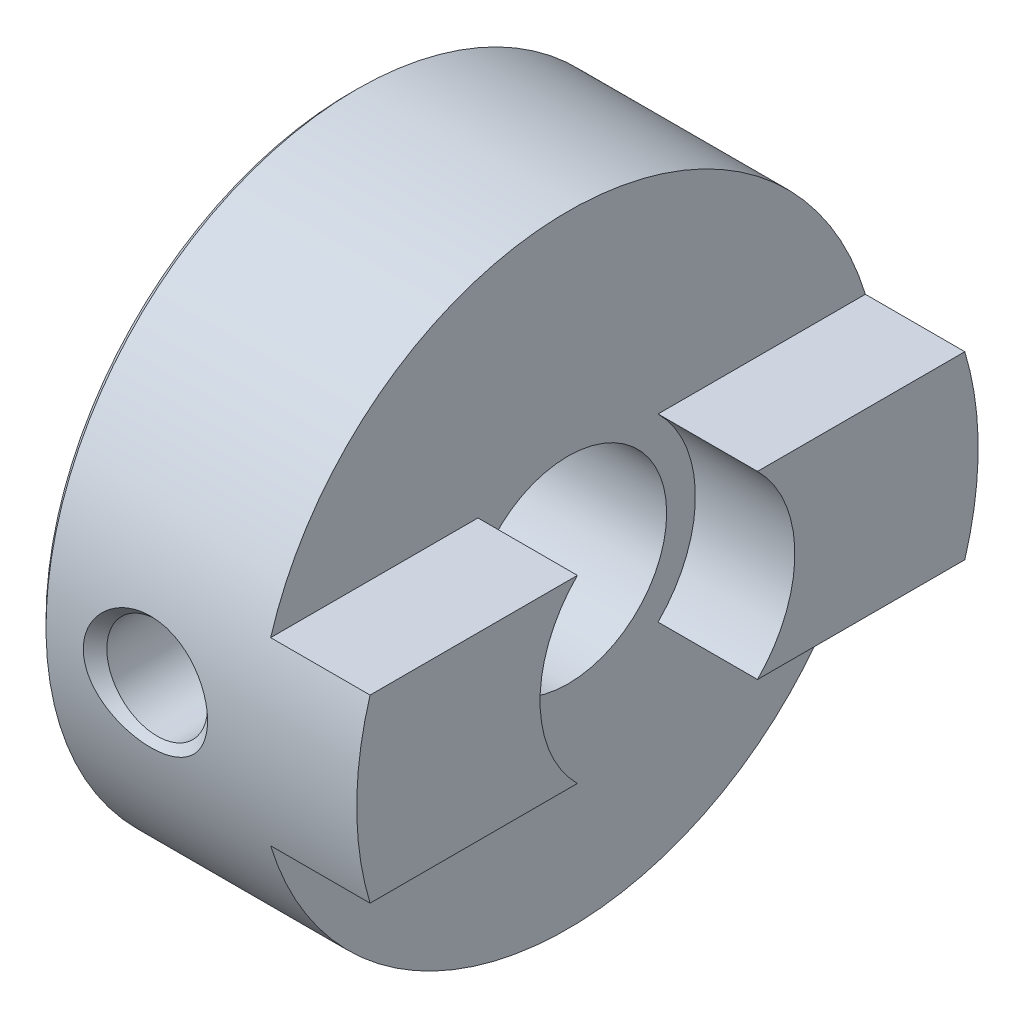
ISO-10303-21;
HEADER;
FILE_DESCRIPTION(('STEP AP214'),'2;1');
FILE_NAME('part.step','',(''),(''),'','','');
FILE_SCHEMA(('AUTOMOTIVE_DESIGN { 1 0 10303 214 1 1 1 1 }'));
ENDSEC;
DATA;
#1=APPLICATION_CONTEXT('core data for automotive mechanical design processes');
#2=APPLICATION_PROTOCOL_DEFINITION('international standard','automotive_design',2000,#1);
#3=PRODUCT_CONTEXT('',#1,'mechanical');
#4=PRODUCT('Part','Part','',(#3));
#5=PRODUCT_RELATED_PRODUCT_CATEGORY('part','',(#4));
#6=PRODUCT_DEFINITION_FORMATION('','',#4);
#7=PRODUCT_DEFINITION_CONTEXT('part definition',#1,'design');
#8=PRODUCT_DEFINITION('design','',#6,#7);
#9=PRODUCT_DEFINITION_SHAPE('','',#8);
#10=(LENGTH_UNIT() NAMED_UNIT(*) SI_UNIT(.MILLI.,.METRE.));
#11=(NAMED_UNIT(*) PLANE_ANGLE_UNIT() SI_UNIT($,.RADIAN.));
#12=(NAMED_UNIT(*) SI_UNIT($,.STERADIAN.) SOLID_ANGLE_UNIT());
#13=UNCERTAINTY_MEASURE_WITH_UNIT(LENGTH_MEASURE(1.E-05),#10,'distance_accuracy_value','');
#14=(GEOMETRIC_REPRESENTATION_CONTEXT(3) GLOBAL_UNCERTAINTY_ASSIGNED_CONTEXT((#13)) GLOBAL_UNIT_ASSIGNED_CONTEXT((#10,
#11,#12)) REPRESENTATION_CONTEXT('',''));
#15=CARTESIAN_POINT('',(0.,0.,0.));
#16=DIRECTION('',(0.,0.,1.));
#17=DIRECTION('',(1.,0.,0.));
#18=AXIS2_PLACEMENT_3D('',#15,#16,#17);
#19=CARTESIAN_POINT('',(-2.1,0.,0.));
#20=DIRECTION('',(1.,0.,0.));
#21=DIRECTION('',(0.,0.,-1.));
#22=AXIS2_PLACEMENT_3D('',#19,#20,#21);
#23=CYLINDRICAL_SURFACE('',#22,4.1);
#24=CARTESIAN_POINT('',(-3.7,0.,0.));
#25=DIRECTION('',(1.,0.,0.));
#26=DIRECTION('',(0.,0.,-1.));
#27=AXIS2_PLACEMENT_3D('',#24,#25,#26);
#28=CIRCLE('',#27,4.1);
#29=CARTESIAN_POINT('',(-3.7,-2.9,2.89827534923789));
#30=VERTEX_POINT('',#29);
#31=CARTESIAN_POINT('',(-3.7,2.9,2.89827534923789));
#32=VERTEX_POINT('',#31);
#33=EDGE_CURVE('E205',#30,#32,#28,.F.);
#34=ORIENTED_EDGE('',*,*,#33,.T.);
#35=DIRECTION('',(1.,0.,0.));
#36=VECTOR('',#35,1.);
#37=CARTESIAN_POINT('',(-0.5,2.9,2.89827534923789));
#38=LINE('',#37,#36);
#39=CARTESIAN_POINT('',(-0.5,2.9,2.89827534923789));
#40=VERTEX_POINT('',#39);
#41=EDGE_CURVE('E121',#32,#40,#38,.T.);
#42=ORIENTED_EDGE('',*,*,#41,.T.);
#43=CARTESIAN_POINT('',(-0.5,0.,0.));
#44=DIRECTION('',(1.,0.,0.));
#45=DIRECTION('',(0.,0.,-1.));
#46=AXIS2_PLACEMENT_3D('',#43,#44,#45);
#47=CIRCLE('',#46,4.1);
#48=CARTESIAN_POINT('',(-0.5,-2.9,2.89827534923789));
#49=VERTEX_POINT('',#48);
#50=EDGE_CURVE('E123',#49,#40,#47,.F.);
#51=ORIENTED_EDGE('',*,*,#50,.F.);
#52=DIRECTION('',(1.,0.,0.));
#53=VECTOR('',#52,1.);
#54=CARTESIAN_POINT('',(-0.5,-2.9,2.89827534923789));
#55=LINE('',#54,#53);
#56=EDGE_CURVE('E105',#49,#30,#55,.F.);
#57=ORIENTED_EDGE('',*,*,#56,.T.);
#58=EDGE_LOOP('',(#34,#42,#51,#57));
#59=FACE_BOUND('',#58,.T.);
#60=ADVANCED_FACE('F17',(#59),#23,.F.);
#61=CARTESIAN_POINT('',(-2.1,0.,0.));
#62=DIRECTION('',(1.,0.,0.));
#63=DIRECTION('',(0.,0.,-1.));
#64=AXIS2_PLACEMENT_3D('',#61,#62,#63);
#65=CYLINDRICAL_SURFACE('',#64,4.1);
#66=CARTESIAN_POINT('',(-0.5,0.,0.));
#67=DIRECTION('',(1.,0.,0.));
#68=DIRECTION('',(0.,0.,-1.));
#69=AXIS2_PLACEMENT_3D('',#66,#67,#68);
#70=CIRCLE('',#69,4.1);
#71=CARTESIAN_POINT('',(-0.5,2.9,-2.89827534923789));
#72=VERTEX_POINT('',#71);
#73=CARTESIAN_POINT('',(-0.5,-2.9,-2.89827534923789));
#74=VERTEX_POINT('',#73);
#75=EDGE_CURVE('E20',#72,#74,#70,.F.);
#76=ORIENTED_EDGE('',*,*,#75,.F.);
#77=DIRECTION('',(1.,0.,0.));
#78=VECTOR('',#77,1.);
#79=CARTESIAN_POINT('',(-0.5,2.9,-2.89827534923789));
#80=LINE('',#79,#78);
#81=CARTESIAN_POINT('',(-3.7,2.9,-2.89827534923789));
#82=VERTEX_POINT('',#81);
#83=EDGE_CURVE('E79',#72,#82,#80,.F.);
#84=ORIENTED_EDGE('',*,*,#83,.T.);
#85=CARTESIAN_POINT('',(-3.7,0.,0.));
#86=DIRECTION('',(1.,0.,0.));
#87=DIRECTION('',(0.,0.,-1.));
#88=AXIS2_PLACEMENT_3D('',#85,#86,#87);
#89=CIRCLE('',#88,4.1);
#90=CARTESIAN_POINT('',(-3.7,-2.9,-2.89827534923789));
#91=VERTEX_POINT('',#90);
#92=EDGE_CURVE('E89',#82,#91,#89,.F.);
#93=ORIENTED_EDGE('',*,*,#92,.T.);
#94=DIRECTION('',(1.,0.,0.));
#95=VECTOR('',#94,1.);
#96=CARTESIAN_POINT('',(-0.5,-2.9,-2.89827534923789));
#97=LINE('',#96,#95);
#98=EDGE_CURVE('E84',#91,#74,#97,.T.);
#99=ORIENTED_EDGE('',*,*,#98,.T.);
#100=EDGE_LOOP('',(#76,#84,#93,#99));
#101=FACE_BOUND('',#100,.T.);
#102=ADVANCED_FACE('F86',(#101),#65,.F.);
#103=CARTESIAN_POINT('',(-0.5,2.9,10.));
#104=DIRECTION('',(0.,-1.,0.));
#105=DIRECTION('',(0.,0.,-1.));
#106=AXIS2_PLACEMENT_3D('',#103,#104,#105);
#107=PLANE('',#106);
#108=DIRECTION('',(0.,0.,1.));
#109=VECTOR('',#108,1.);
#110=CARTESIAN_POINT('',(-3.7,2.9,0.));
#111=LINE('',#110,#109);
#112=CARTESIAN_POINT('',(-3.7,2.9,-9.57026645397086));
#113=VERTEX_POINT('',#112);
#114=EDGE_CURVE('E204',#113,#82,#111,.T.);
#115=ORIENTED_EDGE('',*,*,#114,.T.);
#116=ORIENTED_EDGE('',*,*,#83,.F.);
#117=DIRECTION('',(0.,0.,-1.));
#118=VECTOR('',#117,1.);
#119=CARTESIAN_POINT('',(-0.5,2.9,0.));
#120=LINE('',#119,#118);
#121=CARTESIAN_POINT('',(-0.5,2.9,-9.57026645397086));
#122=VERTEX_POINT('',#121);
#123=EDGE_CURVE('E100',#122,#72,#120,.F.);
#124=ORIENTED_EDGE('',*,*,#123,.F.);
#125=DIRECTION('',(1.,0.,0.));
#126=VECTOR('',#125,1.);
#127=CARTESIAN_POINT('',(-5.5,2.9,-9.57026645397086));
#128=LINE('',#127,#126);
#129=EDGE_CURVE('E113',#113,#122,#128,.T.);
#130=ORIENTED_EDGE('',*,*,#129,.F.);
#131=EDGE_LOOP('',(#115,#116,#124,#130));
#132=FACE_BOUND('',#131,.T.);
#133=ADVANCED_FACE('F261',(#132),#107,.F.);
#134=CARTESIAN_POINT('',(-0.5,6.5875,0.));
#135=DIRECTION('',(1.,0.,0.));
#136=DIRECTION('',(0.,0.,-1.));
#137=AXIS2_PLACEMENT_3D('',#134,#135,#136);
#138=PLANE('',#137);
#139=ORIENTED_EDGE('',*,*,#123,.T.);
#140=ORIENTED_EDGE('',*,*,#75,.T.);
#141=DIRECTION('',(0.,0.,1.));
#142=VECTOR('',#141,1.);
#143=CARTESIAN_POINT('',(-0.5,-2.9,-10.));
#144=LINE('',#143,#142);
#145=CARTESIAN_POINT('',(-0.5,-2.9,-9.57026645397086));
#146=VERTEX_POINT('',#145);
#147=EDGE_CURVE('E94',#74,#146,#144,.F.);
#148=ORIENTED_EDGE('',*,*,#147,.T.);
#149=CARTESIAN_POINT('',(-0.5,0.,0.));
#150=DIRECTION('',(1.,0.,0.));
#151=DIRECTION('',(0.,0.,-1.));
#152=AXIS2_PLACEMENT_3D('',#149,#150,#151);
#153=CIRCLE('',#152,10.);
#154=EDGE_CURVE('E116',#122,#146,#153,.F.);
#155=ORIENTED_EDGE('',*,*,#154,.F.);
#156=EDGE_LOOP('',(#139,#140,#148,#155));
#157=FACE_BOUND('',#156,.T.);
#158=ADVANCED_FACE('F97',(#157),#138,.T.);
#159=CARTESIAN_POINT('',(-0.5,-2.9,-10.));
#160=DIRECTION('',(0.,1.,0.));
#161=DIRECTION('',(0.,0.,1.));
#162=AXIS2_PLACEMENT_3D('',#159,#160,#161);
#163=PLANE('',#162);
#164=ORIENTED_EDGE('',*,*,#147,.F.);
#165=ORIENTED_EDGE('',*,*,#98,.F.);
#166=DIRECTION('',(0.,0.,1.));
#167=VECTOR('',#166,1.);
#168=CARTESIAN_POINT('',(-3.7,-2.9,0.));
#169=LINE('',#168,#167);
#170=CARTESIAN_POINT('',(-3.7,-2.9,-9.57026645397086));
#171=VERTEX_POINT('',#170);
#172=EDGE_CURVE('E127',#91,#171,#169,.F.);
#173=ORIENTED_EDGE('',*,*,#172,.T.);
#174=DIRECTION('',(1.,0.,0.));
#175=VECTOR('',#174,1.);
#176=CARTESIAN_POINT('',(-5.5,-2.9,-9.57026645397086));
#177=LINE('',#176,#175);
#178=EDGE_CURVE('E103',#146,#171,#177,.F.);
#179=ORIENTED_EDGE('',*,*,#178,.F.);
#180=EDGE_LOOP('',(#164,#165,#173,#179));
#181=FACE_BOUND('',#180,.T.);
#182=ADVANCED_FACE('F101',(#181),#163,.F.);
#183=CARTESIAN_POINT('',(-7.3,-10.0022739999872,0.));
#184=DIRECTION('',(0.,-1.,0.));
#185=DIRECTION('',(0.,0.,-1.));
#186=AXIS2_PLACEMENT_3D('',#183,#184,#185);
#187=CONICAL_SURFACE('',#186,2.00227400000585,0.785398163397449);
#188=CARTESIAN_POINT('',(-7.3,-9.621,0.));
#189=DIRECTION('',(0.,1.,0.));
#190=DIRECTION('',(0.,0.,1.));
#191=AXIS2_PLACEMENT_3D('',#188,#189,#190);
#192=CIRCLE('',#191,1.621);
#193=CARTESIAN_POINT('',(-7.3,-9.621,1.621));
#194=VERTEX_POINT('',#193);
#195=EDGE_CURVE('E125',#194,#194,#192,.T.);
#196=ORIENTED_EDGE('',*,*,#195,.T.);
#197=EDGE_LOOP('',(#196));
#198=FACE_BOUND('',#197,.T.);
#199=CARTESIAN_POINT('',(-9.30000000001864,-10.,0.));
#200=CARTESIAN_POINT('',(-9.2999925340376,-9.99999755725914,0.0996148195624444));
#201=CARTESIAN_POINT('',(-9.29101360697768,-9.9984924671083,0.199359457388424));
#202=CARTESIAN_POINT('',(-9.25552233339023,-9.99265314107644,0.395701415051137));
#203=CARTESIAN_POINT('',(-9.22897653465008,-9.98831350764099,0.492292360410893));
#204=CARTESIAN_POINT('',(-9.1618517708009,-9.97768776991729,0.673394623138583));
#205=CARTESIAN_POINT('',(-9.12226146830677,-9.9715414043654,0.758283591524189));
#206=CARTESIAN_POINT('',(-9.03038340446611,-9.95786104480704,0.920679783218986));
#207=CARTESIAN_POINT('',(-8.97810024071128,-9.9503275534816,0.99818966525084));
#208=CARTESIAN_POINT('',(-8.85852078868316,-9.93402563712437,1.1494893467954));
#209=CARTESIAN_POINT('',(-8.79043501978743,-9.92520780676426,1.22264880526788));
#210=CARTESIAN_POINT('',(-8.64380569462088,-9.90764731008917,1.3576337238272));
#211=CARTESIAN_POINT('',(-8.5652562278766,-9.89890468924997,1.41945273094089));
#212=CARTESIAN_POINT('',(-8.39231772497572,-9.88154739574558,1.53583791047278));
#213=CARTESIAN_POINT('',(-8.29713871517758,-9.87301573086934,1.58924328383247));
#214=CARTESIAN_POINT('',(-8.09951340971945,-9.85788276124745,1.68056476876051));
#215=CARTESIAN_POINT('',(-7.9970678571568,-9.85128125947044,1.71848246147064));
#216=CARTESIAN_POINT('',(-7.7962022932306,-9.84110555959189,1.77578544023877));
#217=CARTESIAN_POINT('',(-7.69815423632011,-9.83732552439389,1.79644800924057));
#218=CARTESIAN_POINT('',(-7.50008000872423,-9.83224782280063,1.82403322118144));
#219=CARTESIAN_POINT('',(-7.4000535980922,-9.83095045940733,1.83095418700672));
#220=CARTESIAN_POINT('',(-7.18031485762784,-9.83095361192452,1.83094915297277));
#221=CARTESIAN_POINT('',(-7.06059081220155,-9.83281380496472,1.82103978951258));
#222=CARTESIAN_POINT('',(-6.82447993148955,-9.8400419691881,1.78156284075108));
#223=CARTESIAN_POINT('',(-6.70809502193693,-9.84541192368153,1.75198414045621));
#224=CARTESIAN_POINT('',(-6.48224179724673,-9.85901352733084,1.67374463782856));
#225=CARTESIAN_POINT('',(-6.3727650673867,-9.86724161231116,1.62510759220223));
#226=CARTESIAN_POINT('',(-6.16401273435801,-9.88556413454388,1.50964361574824));
#227=CARTESIAN_POINT('',(-6.06473529018662,-9.89565823405078,1.4428199756317));
#228=CARTESIAN_POINT('',(-5.88299828794916,-9.91608399654159,1.29485733876793));
#229=CARTESIAN_POINT('',(-5.80008727708235,-9.92639642084073,1.21427191607124));
#230=CARTESIAN_POINT('',(-5.65038108177988,-9.94625175816141,1.03913758198495));
#231=CARTESIAN_POINT('',(-5.58358327647053,-9.95579479615818,0.944590945478113));
#232=CARTESIAN_POINT('',(-5.47390577104834,-9.97210037424167,0.752187437867714));
#233=CARTESIAN_POINT('',(-5.42955173037678,-9.97902317696516,0.655184458849731));
#234=CARTESIAN_POINT('',(-5.35958301148447,-9.99016004892117,0.45464513747522));
#235=CARTESIAN_POINT('',(-5.33391715236953,-9.99438151237319,0.351127488986108));
#236=CARTESIAN_POINT('',(-5.31219329744427,-9.99797268138042,0.205488675695021));
#237=CARTESIAN_POINT('',(-5.30762751167628,-9.99873067356007,0.164536756218179));
#238=CARTESIAN_POINT('',(-5.30152920144143,-9.99974485752838,0.0823973088471977));
#239=CARTESIAN_POINT('',(-5.29999691137152,-10.0000010105401,0.0412097629928932));
#240=CARTESIAN_POINT('',(-5.30000746596234,-9.99999755725915,-0.0996148195624343));
#241=CARTESIAN_POINT('',(-5.3089863930223,-9.99849246710831,-0.199359457388412));
#242=CARTESIAN_POINT('',(-5.34447766660978,-9.99265314107644,-0.395701415051127));
#243=CARTESIAN_POINT('',(-5.37102346534993,-9.98831350764099,-0.492292360410887));
#244=CARTESIAN_POINT('',(-5.4381482291991,-9.97768776991729,-0.673394623138581));
#245=CARTESIAN_POINT('',(-5.47773853169322,-9.9715414043654,-0.758283591524188));
#246=CARTESIAN_POINT('',(-5.56961659553389,-9.95786104480704,-0.920679783218984));
#247=CARTESIAN_POINT('',(-5.62189975928872,-9.95032755348161,-0.998189665250838));
#248=CARTESIAN_POINT('',(-5.74147921131683,-9.93402563712437,-1.1494893467954));
#249=CARTESIAN_POINT('',(-5.80956498021257,-9.92520780676426,-1.22264880526788));
#250=CARTESIAN_POINT('',(-5.95619430537911,-9.90764731008917,-1.35763372382719));
#251=CARTESIAN_POINT('',(-6.0347437721234,-9.89890468924997,-1.41945273094089));
#252=CARTESIAN_POINT('',(-6.20768227502428,-9.88154739574558,-1.53583791047278));
#253=CARTESIAN_POINT('',(-6.30286128482241,-9.87301573086934,-1.58924328383247));
#254=CARTESIAN_POINT('',(-6.50048659028054,-9.85788276124745,-1.68056476876051));
#255=CARTESIAN_POINT('',(-6.6029321428432,-9.85128125947044,-1.71848246147063));
#256=CARTESIAN_POINT('',(-6.80379770676939,-9.84110555959189,-1.77578544023876));
#257=CARTESIAN_POINT('',(-6.90184576367989,-9.83732552439389,-1.79644800924057));
#258=CARTESIAN_POINT('',(-7.09991999127577,-9.83224782280063,-1.82403322118144));
#259=CARTESIAN_POINT('',(-7.19994640190779,-9.83095045940733,-1.83095418700672));
#260=CARTESIAN_POINT('',(-7.41968514237216,-9.83095361192452,-1.83094915297277));
#261=CARTESIAN_POINT('',(-7.53940918779845,-9.83281380496472,-1.82103978951258));
#262=CARTESIAN_POINT('',(-7.77552006851044,-9.8400419691881,-1.78156284075108));
#263=CARTESIAN_POINT('',(-7.89190497806307,-9.84541192368153,-1.75198414045621));
#264=CARTESIAN_POINT('',(-8.11775820275327,-9.85901352733084,-1.67374463782856));
#265=CARTESIAN_POINT('',(-8.2272349326133,-9.86724161231116,-1.62510759220223));
#266=CARTESIAN_POINT('',(-8.43598726564199,-9.88556413454388,-1.50964361574824));
#267=CARTESIAN_POINT('',(-8.53526470981338,-9.89565823405078,-1.4428199756317));
#268=CARTESIAN_POINT('',(-8.71700171205084,-9.91608399654159,-1.29485733876793));
#269=CARTESIAN_POINT('',(-8.79991272291765,-9.92639642084073,-1.21427191607125));
#270=CARTESIAN_POINT('',(-8.94961891822012,-9.94625175816141,-1.03913758198495));
#271=CARTESIAN_POINT('',(-9.01641672352947,-9.95579479615818,-0.944590945478115));
#272=CARTESIAN_POINT('',(-9.12609422895166,-9.97210037424167,-0.752187437867716));
#273=CARTESIAN_POINT('',(-9.17044826962322,-9.97902317696516,-0.655184458849732));
#274=CARTESIAN_POINT('',(-9.24041698851553,-9.99016004892117,-0.45464513747522));
#275=CARTESIAN_POINT('',(-9.26608284763046,-9.99438151237319,-0.351127488986108));
#276=CARTESIAN_POINT('',(-9.28780670255574,-9.99797268138042,-0.205488675695021));
#277=CARTESIAN_POINT('',(-9.29237248832373,-9.99873067356007,-0.164536756218177));
#278=CARTESIAN_POINT('',(-9.29847079855856,-9.99974485752838,-0.0823973088471928));
#279=CARTESIAN_POINT('',(-9.30000308862846,-10.0000010105401,-0.0412097629928865));
#280=CARTESIAN_POINT('',(-9.30000000001864,-10.,0.));
#281=B_SPLINE_CURVE_WITH_KNOTS('',3,(#199,#200,#201,#202,#203,#204,#205,#206,#207,#208,#209,
#210,#211,#212,#213,#214,#215,#216,#217,#218,#219,#220,#221,#222,#223,#224,#225,#226,#227,#228,
#229,#230,#231,#232,#233,#234,#235,#236,#237,#238,#239,#240,#241,#242,#243,#244,#245,#246,#247,
#248,#249,#250,#251,#252,#253,#254,#255,#256,#257,#258,#259,#260,#261,#262,#263,#264,#265,#266,
#267,#268,#269,#270,#271,#272,#273,#274,#275,#276,#277,#278,#279,#280),.UNSPECIFIED.,.T.,.F.,(4,
2,2,2,2,2,2,2,2,2,2,2,2,2,2,2,2,2,2,2,2,2,2,2,2,2,2,2,2,2,2,2,2,2,2,2,2,2,2,2,4),(0.,
0.298666891407613,0.597904170653928,0.878303056333985,1.1586005274356,1.45832840521117,
1.75822630944976,2.08523413780591,2.41220857348963,2.71203589656077,3.01189981024159,
3.37060010573809,3.72950327250591,4.08796047340582,4.44635285756558,4.79275785145422,
5.13910646321367,5.45804956928763,5.77611587368352,5.89966215866398,6.02321798964166,
6.32188488104928,6.6211221602956,6.90152104597566,7.18181851707728,7.48154639485284,
7.78144429909143,8.10845212744758,8.4354265631313,8.73525388620245,9.03511779988327,
9.39381809537977,9.75272126214758,10.1111784630475,10.4695708472073,10.8159758410959,
11.1623244528553,11.4812675589293,11.7993338633252,11.9228801483057,12.0464359792833),.UNSPECIFIED.);
#282=CARTESIAN_POINT('',(-9.30000000001864,-10.,0.));
#283=VERTEX_POINT('',#282);
#284=EDGE_CURVE('E194',#283,#283,#281,.T.);
#285=ORIENTED_EDGE('',*,*,#284,.F.);
#286=EDGE_LOOP('',(#285));
#287=FACE_BOUND('',#286,.T.);
#288=ADVANCED_FACE('F186',(#198,#287),#187,.F.);
#289=CARTESIAN_POINT('',(-0.5,-2.9,-10.));
#290=DIRECTION('',(0.,1.,0.));
#291=DIRECTION('',(0.,0.,1.));
#292=AXIS2_PLACEMENT_3D('',#289,#290,#291);
#293=PLANE('',#292);
#294=DIRECTION('',(0.,0.,1.));
#295=VECTOR('',#294,1.);
#296=CARTESIAN_POINT('',(-3.7,-2.9,0.));
#297=LINE('',#296,#295);
#298=CARTESIAN_POINT('',(-3.7,-2.9,9.57026645397086));
#299=VERTEX_POINT('',#298);
#300=EDGE_CURVE('E206',#299,#30,#297,.F.);
#301=ORIENTED_EDGE('',*,*,#300,.T.);
#302=ORIENTED_EDGE('',*,*,#56,.F.);
#303=DIRECTION('',(0.,0.,-1.));
#304=VECTOR('',#303,1.);
#305=CARTESIAN_POINT('',(-0.5,-2.9,0.));
#306=LINE('',#305,#304);
#307=CARTESIAN_POINT('',(-0.5,-2.9,9.57026645397086));
#308=VERTEX_POINT('',#307);
#309=EDGE_CURVE('E107',#308,#49,#306,.T.);
#310=ORIENTED_EDGE('',*,*,#309,.F.);
#311=DIRECTION('',(1.,0.,0.));
#312=VECTOR('',#311,1.);
#313=CARTESIAN_POINT('',(-5.5,-2.9,9.57026645397086));
#314=LINE('',#313,#312);
#315=EDGE_CURVE('E215',#299,#308,#314,.T.);
#316=ORIENTED_EDGE('',*,*,#315,.F.);
#317=EDGE_LOOP('',(#301,#302,#310,#316));
#318=FACE_BOUND('',#317,.T.);
#319=ADVANCED_FACE('F182',(#318),#293,.F.);
#320=CARTESIAN_POINT('',(-0.5,6.5875,0.));
#321=DIRECTION('',(1.,0.,0.));
#322=DIRECTION('',(0.,0.,-1.));
#323=AXIS2_PLACEMENT_3D('',#320,#321,#322);
#324=PLANE('',#323);
#325=DIRECTION('',(0.,0.,-1.));
#326=VECTOR('',#325,1.);
#327=CARTESIAN_POINT('',(-0.5,2.9,10.));
#328=LINE('',#327,#326);
#329=CARTESIAN_POINT('',(-0.5,2.9,9.57026645397086));
#330=VERTEX_POINT('',#329);
#331=EDGE_CURVE('E122',#40,#330,#328,.F.);
#332=ORIENTED_EDGE('',*,*,#331,.T.);
#333=CARTESIAN_POINT('',(-0.5,0.,0.));
#334=DIRECTION('',(1.,0.,0.));
#335=DIRECTION('',(0.,0.,-1.));
#336=AXIS2_PLACEMENT_3D('',#333,#334,#335);
#337=CIRCLE('',#336,10.);
#338=EDGE_CURVE('E217',#308,#330,#337,.F.);
#339=ORIENTED_EDGE('',*,*,#338,.F.);
#340=ORIENTED_EDGE('',*,*,#309,.T.);
#341=ORIENTED_EDGE('',*,*,#50,.T.);
#342=EDGE_LOOP('',(#332,#339,#340,#341));
#343=FACE_BOUND('',#342,.T.);
#344=ADVANCED_FACE('F179',(#343),#324,.T.);
#345=CARTESIAN_POINT('',(-0.5,2.9,10.));
#346=DIRECTION('',(0.,-1.,0.));
#347=DIRECTION('',(0.,0.,-1.));
#348=AXIS2_PLACEMENT_3D('',#345,#346,#347);
#349=PLANE('',#348);
#350=ORIENTED_EDGE('',*,*,#331,.F.);
#351=ORIENTED_EDGE('',*,*,#41,.F.);
#352=DIRECTION('',(0.,0.,1.));
#353=VECTOR('',#352,1.);
#354=CARTESIAN_POINT('',(-3.7,2.9,0.));
#355=LINE('',#354,#353);
#356=CARTESIAN_POINT('',(-3.7,2.9,9.57026645397086));
#357=VERTEX_POINT('',#356);
#358=EDGE_CURVE('E35',#32,#357,#355,.T.);
#359=ORIENTED_EDGE('',*,*,#358,.T.);
#360=DIRECTION('',(1.,0.,0.));
#361=VECTOR('',#360,1.);
#362=CARTESIAN_POINT('',(-5.5,2.9,9.57026645397086));
#363=LINE('',#362,#361);
#364=EDGE_CURVE('E222',#330,#357,#363,.F.);
#365=ORIENTED_EDGE('',*,*,#364,.F.);
#366=EDGE_LOOP('',(#350,#351,#359,#365));
#367=FACE_BOUND('',#366,.T.);
#368=ADVANCED_FACE('F175',(#367),#349,.F.);
#369=CARTESIAN_POINT('',(-7.3,0.,10.0022739999872));
#370=DIRECTION('',(0.,0.,1.));
#371=DIRECTION('',(1.,0.,0.));
#372=AXIS2_PLACEMENT_3D('',#369,#370,#371);
#373=CONICAL_SURFACE('',#372,2.00227399994901,0.785398163397448);
#374=CARTESIAN_POINT('',(-7.3,1.8309518948131,9.8309518948513));
#375=CARTESIAN_POINT('',(-7.18031485763137,1.83094915292485,9.83095361193345));
#376=CARTESIAN_POINT('',(-7.06059081220862,1.82103978946495,9.83281380497354));
#377=CARTESIAN_POINT('',(-6.8244799315036,1.78156284070458,9.84004196919652));
#378=CARTESIAN_POINT('',(-6.70809502195442,1.75198414041056,9.84541192368965));
#379=CARTESIAN_POINT('',(-6.4822417972709,1.67374463778516,9.85901352733821));
#380=CARTESIAN_POINT('',(-6.37276506741411,1.62510759216024,9.86724161231807));
#381=CARTESIAN_POINT('',(-6.16401273439157,1.50964361570958,9.88556413454977));
#382=CARTESIAN_POINT('',(-6.06473529022312,1.44281997559498,9.89565823405611));
#383=CARTESIAN_POINT('',(-5.88299828799096,1.29485733873551,9.91608399654581));
#384=CARTESIAN_POINT('',(-5.80008727712654,1.21427191604115,9.9263964208444));
#385=CARTESIAN_POINT('',(-5.65038108182838,1.03913758195996,9.94625175816399));
#386=CARTESIAN_POINT('',(-5.58358327652092,0.94459094545591,9.95579479616022));
#387=CARTESIAN_POINT('',(-5.47390577110169,0.752187437851013,9.97210037424294));
#388=CARTESIAN_POINT('',(-5.42955173043127,0.6551844588357,9.97902317696616));
#389=CARTESIAN_POINT('',(-5.3595830115405,0.45464513746668,9.99016004892143));
#390=CARTESIAN_POINT('',(-5.33391715242599,0.351127488980386,9.99438151237297));
#391=CARTESIAN_POINT('',(-5.31219329750117,0.205488675692612,9.99797268138062));
#392=CARTESIAN_POINT('',(-5.30762751173329,0.164536756216242,9.99873067356051));
#393=CARTESIAN_POINT('',(-5.30152920149811,0.0823973088462192,9.99974485752797));
#394=CARTESIAN_POINT('',(-5.29999691142777,0.0412097629924012,10.0000010105386));
#395=CARTESIAN_POINT('',(-5.30000746601794,-0.0996148195594564,9.999997557256));
#396=CARTESIAN_POINT('',(-5.30898639307849,-0.199359457382444,9.99849246710755));
#397=CARTESIAN_POINT('',(-5.34447766666537,-0.395701415039372,9.99265314107772));
#398=CARTESIAN_POINT('',(-5.37102346540433,-0.492292360396334,9.9883135076419));
#399=CARTESIAN_POINT('',(-5.4381482292512,-0.673394623119381,9.97768776991836));
#400=CARTESIAN_POINT('',(-5.47773853174431,-0.75828359150309,9.97154140436693));
#401=CARTESIAN_POINT('',(-5.56961659558262,-0.920679783194251,9.95786104480937));
#402=CARTESIAN_POINT('',(-5.62189975933609,-0.998189665224369,9.95032755348426));
#403=CARTESIAN_POINT('',(-5.74147921136108,-1.14948934676536,9.93402563712781));
#404=CARTESIAN_POINT('',(-5.80956498025499,-1.22264880523604,9.92520780676817));
#405=CARTESIAN_POINT('',(-5.95619430541766,-1.35763372379204,9.90764731009398));
#406=CARTESIAN_POINT('',(-6.03474377215989,-1.41945273090422,9.89890468925522));
#407=CARTESIAN_POINT('',(-6.20768227505609,-1.53583791043309,9.88154739575174));
#408=CARTESIAN_POINT('',(-6.30286128485155,-1.58924328379134,9.87301573087596));
#409=CARTESIAN_POINT('',(-6.50048659030413,-1.68056476871691,9.85788276125487));
#410=CARTESIAN_POINT('',(-6.60293214286391,-1.71848246142599,9.85128125947823));
#411=CARTESIAN_POINT('',(-6.80379770678429,-1.77578544019248,9.84110555960024));
#412=CARTESIAN_POINT('',(-6.90184576369184,-1.79644800919367,9.83732552440246));
#413=CARTESIAN_POINT('',(-7.09991999128178,-1.82403322113373,9.83224782280948));
#414=CARTESIAN_POINT('',(-7.1999464019108,-1.8309541869588,9.83095045941626));
#415=CARTESIAN_POINT('',(-7.41968514236863,-1.83094915292485,9.83095361193345));
#416=CARTESIAN_POINT('',(-7.53940918779137,-1.82103978946495,9.83281380497354));
#417=CARTESIAN_POINT('',(-7.77552006849639,-1.78156284070458,9.84004196919652));
#418=CARTESIAN_POINT('',(-7.89190497804558,-1.75198414041056,9.84541192368965));
#419=CARTESIAN_POINT('',(-8.1177582027291,-1.67374463778515,9.85901352733821));
#420=CARTESIAN_POINT('',(-8.2272349325859,-1.62510759216023,9.86724161231807));
#421=CARTESIAN_POINT('',(-8.43598726560843,-1.50964361570958,9.88556413454977));
#422=CARTESIAN_POINT('',(-8.53526470977688,-1.44281997559498,9.89565823405612));
#423=CARTESIAN_POINT('',(-8.71700171200903,-1.29485733873552,9.9160839965458));
#424=CARTESIAN_POINT('',(-8.79991272287344,-1.21427191604116,9.92639642084439));
#425=CARTESIAN_POINT('',(-8.94961891817161,-1.03913758195998,9.94625175816399));
#426=CARTESIAN_POINT('',(-9.01641672347906,-0.944590945455919,9.95579479616026));
#427=CARTESIAN_POINT('',(-9.12609422889832,-0.752187437850999,9.97210037424291));
#428=CARTESIAN_POINT('',(-9.17044826956878,-0.655184458835671,9.97902317696605));
#429=CARTESIAN_POINT('',(-9.24041698845946,-0.454645137466647,9.99016004892153));
#430=CARTESIAN_POINT('',(-9.26608284757386,-0.351127488980367,9.99438151237337));
#431=CARTESIAN_POINT('',(-9.28780670249889,-0.205488675692606,9.99797268138047));
#432=CARTESIAN_POINT('',(-9.29237248826688,-0.164536756216232,9.9987306735601));
#433=CARTESIAN_POINT('',(-9.29847079850173,-0.0823973088461862,9.99974485752839));
#434=CARTESIAN_POINT('',(-9.30000308857164,-0.0412097629923487,10.0000010105401));
#435=CARTESIAN_POINT('',(-9.29999253398081,0.099614819559546,9.99999755725915));
#436=CARTESIAN_POINT('',(-9.29101360692117,0.199359457382551,9.9984924671084));
#437=CARTESIAN_POINT('',(-9.25552233333495,0.395701415039453,9.99265314107687));
#438=CARTESIAN_POINT('',(-9.22897653459574,0.492292360396374,9.98831350764168));
#439=CARTESIAN_POINT('',(-9.16185177074872,0.673394623119372,9.97768776991857));
#440=CARTESIAN_POINT('',(-9.12226146825568,0.758283591503071,9.97154140436699));
#441=CARTESIAN_POINT('',(-9.03038340441742,0.920679783194235,9.95786104480932));
#442=CARTESIAN_POINT('',(-8.97810024066392,0.998189665224363,9.95032755348425));
#443=CARTESIAN_POINT('',(-8.85852078863891,1.14948934676537,9.93402563712783));
#444=CARTESIAN_POINT('',(-8.790435019745,1.22264880523605,9.92520780676817));
#445=CARTESIAN_POINT('',(-8.64380569458233,1.35763372379205,9.90764731009397));
#446=CARTESIAN_POINT('',(-8.5652562278401,1.41945273090422,9.89890468925522));
#447=CARTESIAN_POINT('',(-8.39231772494391,1.53583791043309,9.88154739575174));
#448=CARTESIAN_POINT('',(-8.29713871514846,1.58924328379134,9.87301573087596));
#449=CARTESIAN_POINT('',(-8.09951340969588,1.68056476871691,9.85788276125488));
#450=CARTESIAN_POINT('',(-7.99706785713609,1.718482461426,9.85128125947823));
#451=CARTESIAN_POINT('',(-7.79620229321571,1.77578544019248,9.84110555960024));
#452=CARTESIAN_POINT('',(-7.69815423630815,1.79644800919368,9.83732552440246));
#453=CARTESIAN_POINT('',(-7.50008000871822,1.82403322113373,9.83224782280948));
#454=CARTESIAN_POINT('',(-7.4000535980892,1.8309541869588,9.83095045941626));
#455=CARTESIAN_POINT('',(-7.3,1.8309518948131,9.8309518948513));
#456=B_SPLINE_CURVE_WITH_KNOTS('',3,(#374,#375,#376,#377,#378,#379,#380,#381,#382,#383,#384,
#385,#386,#387,#388,#389,#390,#391,#392,#393,#394,#395,#396,#397,#398,#399,#400,#401,#402,#403,
#404,#405,#406,#407,#408,#409,#410,#411,#412,#413,#414,#415,#416,#417,#418,#419,#420,#421,#422,
#423,#424,#425,#426,#427,#428,#429,#430,#431,#432,#433,#434,#435,#436,#437,#438,#439,#440,#441,
#442,#443,#444,#445,#446,#447,#448,#449,#450,#451,#452,#453,#454,#455),.UNSPECIFIED.,.T.,.F.,(4,
2,2,2,2,2,2,2,2,2,2,2,2,2,2,2,2,2,2,2,2,2,2,2,2,2,2,2,2,2,2,2,2,2,2,2,2,2,2,2,4),(0.,
0.358700295485909,0.717603462243118,1.07606066313243,1.43445304728161,1.78085804116018,
2.12720665290949,2.44614975897479,2.76421606336215,2.88776234834119,3.01131817931744,
3.30998507071616,3.60922234995367,3.88962123562719,4.16991870672219,4.46964658449002,
4.76954448872089,5.09655231706789,5.42352675274244,5.72335407580457,6.02321798947638,
6.38191828496229,6.7408214517195,7.09927865260882,7.45767103675799,7.80407603063653,
8.15042464238587,8.46936774845122,8.78743405283853,8.91098033781759,9.03453616879388,
9.3332030601926,9.63244033943,9.91283922510348,10.1931366961985,10.4928645739664,
10.7927624781972,11.1197703065442,11.4467447422188,11.7465720652809,12.0464359789527),.UNSPECIFIED.);
#457=CARTESIAN_POINT('',(-7.3,1.8309518948131,9.8309518948513));
#458=VERTEX_POINT('',#457);
#459=EDGE_CURVE('E161',#458,#458,#456,.T.);
#460=ORIENTED_EDGE('',*,*,#459,.F.);
#461=EDGE_LOOP('',(#460));
#462=FACE_BOUND('',#461,.T.);
#463=CARTESIAN_POINT('',(-7.3,0.,9.621));
#464=DIRECTION('',(0.,0.,-1.));
#465=DIRECTION('',(-1.,0.,0.));
#466=AXIS2_PLACEMENT_3D('',#463,#464,#465);
#467=CIRCLE('',#466,1.621);
#468=CARTESIAN_POINT('',(-8.921,0.,9.621));
#469=VERTEX_POINT('',#468);
#470=EDGE_CURVE('E117',#469,#469,#467,.T.);
#471=ORIENTED_EDGE('',*,*,#470,.T.);
#472=EDGE_LOOP('',(#471));
#473=FACE_BOUND('',#472,.T.);
#474=ADVANCED_FACE('F170',(#462,#473),#373,.F.);
#475=CARTESIAN_POINT('',(-7.3,-4.8105,0.));
#476=DIRECTION('',(0.,1.,0.));
#477=DIRECTION('',(0.,0.,1.));
#478=AXIS2_PLACEMENT_3D('',#475,#476,#477);
#479=CYLINDRICAL_SURFACE('',#478,1.621);
#480=CARTESIAN_POINT('',(-8.921,-3.175,0.));
#481=CARTESIAN_POINT('',(-8.92099792228048,-3.17499811072103,0.085097180110755));
#482=CARTESIAN_POINT('',(-8.914267470406,-3.17154671922647,0.170213792123194));
#483=CARTESIAN_POINT('',(-8.88767462235305,-3.15809538525747,0.337851996641708));
#484=CARTESIAN_POINT('',(-8.86780459365703,-3.14809163668189,0.420372051656411));
#485=CARTESIAN_POINT('',(-8.81591744031881,-3.12257639483891,0.580238998846356));
#486=CARTESIAN_POINT('',(-8.78394224583867,-3.10708392528989,0.657602676076681));
#487=CARTESIAN_POINT('',(-8.70899989020991,-3.07199773814129,0.805766655313081));
#488=CARTESIAN_POINT('',(-8.66603063957061,-3.05240324105398,0.876565706181281));
#489=CARTESIAN_POINT('',(-8.56729496850147,-3.00947208459838,1.01451508458405));
#490=CARTESIAN_POINT('',(-8.51089930937247,-2.98597855902083,1.08116539331901));
#491=CARTESIAN_POINT('',(-8.38826477673825,-2.93838566923678,1.20453111259612));
#492=CARTESIAN_POINT('',(-8.32201753138685,-2.91428580437948,1.26123798304185));
#493=CARTESIAN_POINT('',(-8.17506197713918,-2.86592325089602,1.36777409466304));
#494=CARTESIAN_POINT('',(-8.09361298646834,-2.84180959723599,1.4166566263222));
#495=CARTESIAN_POINT('',(-7.92233110311342,-2.79883163669346,1.49979094156894));
#496=CARTESIAN_POINT('',(-7.83251063499514,-2.77995971088698,1.53406399941435));
#497=CARTESIAN_POINT('',(-7.66882637051377,-2.7539254444329,1.58020412752611));
#498=CARTESIAN_POINT('',(-7.59617787410617,-2.74505303712172,1.59544502037775));
#499=CARTESIAN_POINT('',(-7.44902397307528,-2.73309817366611,1.61584122069619));
#500=CARTESIAN_POINT('',(-7.37451962522498,-2.73001249546248,1.62100214077295));
#501=CARTESIAN_POINT('',(-7.21571948393422,-2.73001865210919,1.62099757881969));
#502=CARTESIAN_POINT('',(-7.13141942619382,-2.7339725838671,1.61439095650011));
#503=CARTESIAN_POINT('',(-6.96548490922642,-2.74918719887406,1.58833581552302));
#504=CARTESIAN_POINT('',(-6.88385286060037,-2.76045430794481,1.56887600297191));
#505=CARTESIAN_POINT('',(-6.72588472756178,-2.7886497321811,1.51818481082911));
#506=CARTESIAN_POINT('',(-6.64952425423076,-2.80554952420024,1.4870126417653));
#507=CARTESIAN_POINT('',(-6.50311806675976,-2.84305917615917,1.41397335503441));
#508=CARTESIAN_POINT('',(-6.43307426259636,-2.86367015264526,1.37210301712525));
#509=CARTESIAN_POINT('',(-6.29465969187388,-2.90844264776248,1.27463697293594));
#510=CARTESIAN_POINT('',(-6.22695156069141,-2.93275707446304,1.21817022053583));
#511=CARTESIAN_POINT('',(-6.10144222947777,-2.9809668604705,1.09491629559798));
#512=CARTESIAN_POINT('',(-6.04364682223085,-3.00486196746437,1.02812313157827));
#513=CARTESIAN_POINT('',(-5.93557118925498,-3.05157450006811,0.88030682727409));
#514=CARTESIAN_POINT('',(-5.88612114269339,-3.07419346001303,0.798608486416779));
#515=CARTESIAN_POINT('',(-5.80200188811669,-3.11377579565549,0.626711332523632));
#516=CARTESIAN_POINT('',(-5.76731346896633,-3.13074651579749,0.536523755518144));
#517=CARTESIAN_POINT('',(-5.72047534564028,-3.15397796492545,0.371879552453127));
#518=CARTESIAN_POINT('',(-5.70497455485945,-3.16180521084967,0.298584362528774));
#519=CARTESIAN_POINT('',(-5.68423755336183,-3.17231626629152,0.150197451890016));
#520=CARTESIAN_POINT('',(-5.67899816621639,-3.17500166746703,0.0751062944071247));
#521=CARTESIAN_POINT('',(-5.67900207771952,-3.17499811072103,-0.0850971801107552));
#522=CARTESIAN_POINT('',(-5.685732529594,-3.17154671922647,-0.170213792123195));
#523=CARTESIAN_POINT('',(-5.71232537764695,-3.15809538525747,-0.337851996641709));
#524=CARTESIAN_POINT('',(-5.73219540634297,-3.14809163668189,-0.420372051656412));
#525=CARTESIAN_POINT('',(-5.78408255968119,-3.12257639483891,-0.580238998846356));
#526=CARTESIAN_POINT('',(-5.81605775416133,-3.10708392528989,-0.657602676076681));
#527=CARTESIAN_POINT('',(-5.89100010979009,-3.07199773814129,-0.805766655313081));
#528=CARTESIAN_POINT('',(-5.93396936042939,-3.05240324105398,-0.876565706181281));
#529=CARTESIAN_POINT('',(-6.03270503149852,-3.00947208459838,-1.01451508458405));
#530=CARTESIAN_POINT('',(-6.08910069062753,-2.98597855902083,-1.08116539331901));
#531=CARTESIAN_POINT('',(-6.21173522326175,-2.93838566923678,-1.20453111259612));
#532=CARTESIAN_POINT('',(-6.27798246861315,-2.91428580437948,-1.26123798304185));
#533=CARTESIAN_POINT('',(-6.42493802286082,-2.86592325089602,-1.36777409466304));
#534=CARTESIAN_POINT('',(-6.50638701353166,-2.84180959723599,-1.4166566263222));
#535=CARTESIAN_POINT('',(-6.67766889688658,-2.79883163669346,-1.49979094156894));
#536=CARTESIAN_POINT('',(-6.76748936500486,-2.77995971088698,-1.53406399941435));
#537=CARTESIAN_POINT('',(-6.93117362948623,-2.7539254444329,-1.58020412752611));
#538=CARTESIAN_POINT('',(-7.00382212589383,-2.74505303712172,-1.59544502037775));
#539=CARTESIAN_POINT('',(-7.15097602692472,-2.73309817366611,-1.61584122069619));
#540=CARTESIAN_POINT('',(-7.22548037477502,-2.73001249546248,-1.62100214077295));
#541=CARTESIAN_POINT('',(-7.38428051606578,-2.73001865210919,-1.62099757881969));
#542=CARTESIAN_POINT('',(-7.46858057380618,-2.7339725838671,-1.61439095650011));
#543=CARTESIAN_POINT('',(-7.63451509077357,-2.74918719887406,-1.58833581552302));
#544=CARTESIAN_POINT('',(-7.71614713939963,-2.76045430794481,-1.56887600297192));
#545=CARTESIAN_POINT('',(-7.87411527243822,-2.7886497321811,-1.51818481082911));
#546=CARTESIAN_POINT('',(-7.95047574576924,-2.80554952420024,-1.4870126417653));
#547=CARTESIAN_POINT('',(-8.09688193324023,-2.84305917615917,-1.41397335503441));
#548=CARTESIAN_POINT('',(-8.16692573740364,-2.86367015264526,-1.37210301712525));
#549=CARTESIAN_POINT('',(-8.30534030812612,-2.90844264776248,-1.27463697293594));
#550=CARTESIAN_POINT('',(-8.37304843930858,-2.93275707446304,-1.21817022053583));
#551=CARTESIAN_POINT('',(-8.49855777052223,-2.9809668604705,-1.09491629559798));
#552=CARTESIAN_POINT('',(-8.55635317776915,-3.00486196746437,-1.02812313157828));
#553=CARTESIAN_POINT('',(-8.66442881074502,-3.05157450006811,-0.880306827274094));
#554=CARTESIAN_POINT('',(-8.71387885730661,-3.07419346001303,-0.798608486416783));
#555=CARTESIAN_POINT('',(-8.79799811188331,-3.11377579565549,-0.626711332523635));
#556=CARTESIAN_POINT('',(-8.83268653103366,-3.13074651579749,-0.536523755518148));
#557=CARTESIAN_POINT('',(-8.87952465435972,-3.15397796492545,-0.37187955245313));
#558=CARTESIAN_POINT('',(-8.89502544514055,-3.16180521084967,-0.298584362528777));
#559=CARTESIAN_POINT('',(-8.91576244663817,-3.17231626629152,-0.150197451890017));
#560=CARTESIAN_POINT('',(-8.92100183378361,-3.17500166746703,-0.0751062944071255));
#561=CARTESIAN_POINT('',(-8.921,-3.175,0.));
#562=B_SPLINE_CURVE_WITH_KNOTS('',3,(#480,#481,#482,#483,#484,#485,#486,#487,#488,#489,#490,
#491,#492,#493,#494,#495,#496,#497,#498,#499,#500,#501,#502,#503,#504,#505,#506,#507,#508,#509,
#510,#511,#512,#513,#514,#515,#516,#517,#518,#519,#520,#521,#522,#523,#524,#525,#526,#527,#528,
#529,#530,#531,#532,#533,#534,#535,#536,#537,#538,#539,#540,#541,#542,#543,#544,#545,#546,#547,
#548,#549,#550,#551,#552,#553,#554,#555,#556,#557,#558,#559,#560,#561),.UNSPECIFIED.,.T.,.F.,(4,
2,2,2,2,2,2,2,2,2,2,2,2,2,2,2,2,2,2,2,2,2,2,2,2,2,2,2,2,2,2,2,2,2,2,2,2,2,2,2,4),(0.,
0.25499982661948,0.510147907810289,0.764420169420081,1.01874079304304,1.28886296163599,
1.55921600499232,1.85176217068134,2.14388086431676,2.36729849531988,2.59059169008314,
2.8431327573766,3.09589602421786,3.3473983011113,3.5989763717527,3.87220317453237,
4.14558910519418,4.43847669567456,4.73098194080081,4.95611305973774,5.18117447807054,
5.43617430469002,5.69132238588083,5.94559464749062,6.19991527111358,6.47003743970653,
6.74039048306286,7.03293664875188,7.32505534238731,7.54847297339041,7.77176616815368,
8.02430723544713,8.2770705022884,8.52857277918184,8.78015084982323,9.0533776526029,
9.32676358326472,9.6196511737451,9.91215641887135,10.1372875378083,10.3623489561411),.UNSPECIFIED.);
#563=CARTESIAN_POINT('',(-8.921,-3.175,0.));
#564=VERTEX_POINT('',#563);
#565=EDGE_CURVE('E155',#564,#564,#562,.T.);
#566=ORIENTED_EDGE('',*,*,#565,.T.);
#567=EDGE_LOOP('',(#566));
#568=FACE_BOUND('',#567,.T.);
#569=ORIENTED_EDGE('',*,*,#195,.F.);
#570=EDGE_LOOP('',(#569));
#571=FACE_BOUND('',#570,.T.);
#572=ADVANCED_FACE('F166',(#568,#571),#479,.F.);
#573=CARTESIAN_POINT('',(-3.7,2.05,0.));
#574=DIRECTION('',(-1.,0.,0.));
#575=DIRECTION('',(0.,0.,1.));
#576=AXIS2_PLACEMENT_3D('',#573,#574,#575);
#577=PLANE('',#576);
#578=CARTESIAN_POINT('',(-3.7,0.,0.));
#579=DIRECTION('',(1.,0.,0.));
#580=DIRECTION('',(0.,0.,-1.));
#581=AXIS2_PLACEMENT_3D('',#578,#579,#580);
#582=CIRCLE('',#581,3.175);
#583=CARTESIAN_POINT('',(-3.7,0.,-3.175));
#584=VERTEX_POINT('',#583);
#585=EDGE_CURVE('E139',#584,#584,#582,.F.);
#586=ORIENTED_EDGE('',*,*,#585,.T.);
#587=EDGE_LOOP('',(#586));
#588=FACE_BOUND('',#587,.T.);
#589=ORIENTED_EDGE('',*,*,#114,.F.);
#590=CARTESIAN_POINT('',(-3.7,0.,0.));
#591=DIRECTION('',(1.,0.,0.));
#592=DIRECTION('',(0.,0.,-1.));
#593=AXIS2_PLACEMENT_3D('',#590,#591,#592);
#594=CIRCLE('',#593,10.);
#595=EDGE_CURVE('E231',#357,#113,#594,.F.);
#596=ORIENTED_EDGE('',*,*,#595,.F.);
#597=ORIENTED_EDGE('',*,*,#358,.F.);
#598=ORIENTED_EDGE('',*,*,#33,.F.);
#599=ORIENTED_EDGE('',*,*,#300,.F.);
#600=CARTESIAN_POINT('',(-3.7,0.,0.));
#601=DIRECTION('',(1.,0.,0.));
#602=DIRECTION('',(0.,0.,-1.));
#603=AXIS2_PLACEMENT_3D('',#600,#601,#602);
#604=CIRCLE('',#603,10.);
#605=EDGE_CURVE('E200',#171,#299,#604,.F.);
#606=ORIENTED_EDGE('',*,*,#605,.F.);
#607=ORIENTED_EDGE('',*,*,#172,.F.);
#608=ORIENTED_EDGE('',*,*,#92,.F.);
#609=EDGE_LOOP('',(#589,#596,#597,#598,#599,#606,#607,#608));
#610=FACE_BOUND('',#609,.T.);
#611=ADVANCED_FACE('F169',(#588,#610),#577,.F.);
#612=CARTESIAN_POINT('',(-7.3,0.,4.8105));
#613=DIRECTION('',(0.,0.,-1.));
#614=DIRECTION('',(-1.,0.,0.));
#615=AXIS2_PLACEMENT_3D('',#612,#613,#614);
#616=CYLINDRICAL_SURFACE('',#615,1.621);
#617=ORIENTED_EDGE('',*,*,#470,.F.);
#618=EDGE_LOOP('',(#617));
#619=FACE_BOUND('',#618,.T.);
#620=CARTESIAN_POINT('',(-7.3,-1.621,2.73001538457204));
#621=CARTESIAN_POINT('',(-7.38425072700495,-1.62099518746763,2.730021661445));
#622=CARTESIAN_POINT('',(-7.46854777016192,-1.61439258164757,2.73397201821604));
#623=CARTESIAN_POINT('',(-7.63449149065076,-1.58834305343074,2.7491825863461));
#624=CARTESIAN_POINT('',(-7.71613481236712,-1.56888048561107,2.76045170141658));
#625=CARTESIAN_POINT('',(-7.87411597663433,-1.51818406060646,2.78865026208564));
#626=CARTESIAN_POINT('',(-7.95047890916368,-1.48701115986083,2.80555034586217));
#627=CARTESIAN_POINT('',(-8.09688538288153,-1.41397153751561,2.843060049669));
#628=CARTESIAN_POINT('',(-8.16692729928806,-1.37210207695995,2.8636706194048));
#629=CARTESIAN_POINT('',(-8.30534371981414,-1.27463439715843,2.90844379310001));
#630=CARTESIAN_POINT('',(-8.37305502982011,-1.21816433164178,2.93275943679053));
#631=CARTESIAN_POINT('',(-8.49856335419485,-1.09491022854267,2.98096917409072));
#632=CARTESIAN_POINT('',(-8.55635553773373,-1.02812119531688,3.00486305724041));
#633=CARTESIAN_POINT('',(-8.6644108538069,-0.880330003953212,3.05156666400133));
#634=CARTESIAN_POINT('',(-8.71384749376193,-0.798655217396185,3.07417879262199));
#635=CARTESIAN_POINT('',(-8.79797464418498,-0.626776597461016,3.11376465973603));
#636=CARTESIAN_POINT('',(-8.83267482249072,-0.536578403492049,3.13074209326177));
#637=CARTESIAN_POINT('',(-8.88368204729604,-0.357253091888717,3.15603872592123));
#638=CARTESIAN_POINT('',(-8.90115575558722,-0.268536567525013,3.16490362077295));
#639=CARTESIAN_POINT('',(-8.92106633699637,-0.0890229413368557,3.17502155394343));
#640=CARTESIAN_POINT('',(-8.92351270384881,0.00177281050185662,3.17627939811575));
#641=CARTESIAN_POINT('',(-8.9137259315936,0.17405364606437,3.17129088600341));
#642=CARTESIAN_POINT('',(-8.90280234868275,0.255637155781834,3.1657139186245));
#643=CARTESIAN_POINT('',(-8.86894348187238,0.415624631170307,3.14870668931627));
#644=CARTESIAN_POINT('',(-8.84600734540069,0.494028370736503,3.13727601193033));
#645=CARTESIAN_POINT('',(-8.78865232515246,0.646763450651605,3.10941073048862));
#646=CARTESIAN_POINT('',(-8.75408426969698,0.721026471160497,3.09291137645779));
#647=CARTESIAN_POINT('',(-8.67466715833264,0.862870420297677,3.05637887881621));
#648=CARTESIAN_POINT('',(-8.6298146214598,0.930449075374159,3.03634453925771));
#649=CARTESIAN_POINT('',(-8.526094301366,1.06403214840578,2.99230266027765));
#650=CARTESIAN_POINT('',(-8.46628713636392,1.12924268571037,2.96809819483253));
#651=CARTESIAN_POINT('',(-8.33684148202471,1.24915768080476,2.91966128677323));
#652=CARTESIAN_POINT('',(-8.26719332697746,1.30385168317145,2.89542884016663));
#653=CARTESIAN_POINT('',(-8.11422433584467,1.40486615168589,2.84785955082591));
#654=CARTESIAN_POINT('',(-8.03029250143426,1.45035165407619,2.82469902146984));
#655=CARTESIAN_POINT('',(-7.85457622004406,1.52616922513539,2.78447412160593));
#656=CARTESIAN_POINT('',(-7.76280952306772,1.55653453491433,2.76739640205668));
#657=CARTESIAN_POINT('',(-7.60851926729315,1.59256665862997,2.74674511117746));
#658=CARTESIAN_POINT('',(-7.54747434783772,1.60319795430021,2.74051979213663));
#659=CARTESIAN_POINT('',(-7.42429453004915,1.61741563666221,2.73215305599439));
#660=CARTESIAN_POINT('',(-7.36215987096845,1.62100355066837,2.73001075351866));
#661=CARTESIAN_POINT('',(-7.21574927299505,1.62099518746763,2.730021661445));
#662=CARTESIAN_POINT('',(-7.13145222983808,1.61439258164757,2.73397201821604));
#663=CARTESIAN_POINT('',(-6.96550850934923,1.58834305343074,2.7491825863461));
#664=CARTESIAN_POINT('',(-6.88386518763288,1.56888048561107,2.76045170141658));
#665=CARTESIAN_POINT('',(-6.72588402336567,1.51818406060646,2.78865026208564));
#666=CARTESIAN_POINT('',(-6.64952109083632,1.48701115986083,2.80555034586217));
#667=CARTESIAN_POINT('',(-6.50311461711847,1.41397153751561,2.843060049669));
#668=CARTESIAN_POINT('',(-6.43307270071194,1.37210207695995,2.8636706194048));
#669=CARTESIAN_POINT('',(-6.29465628018586,1.27463439715843,2.90844379310001));
#670=CARTESIAN_POINT('',(-6.22694497017989,1.21816433164178,2.93275943679053));
#671=CARTESIAN_POINT('',(-6.10143664580515,1.09491022854267,2.98096917409072));
#672=CARTESIAN_POINT('',(-6.04364446226626,1.02812119531688,3.00486305724041));
#673=CARTESIAN_POINT('',(-5.9355891461931,0.880330003953211,3.05156666400133));
#674=CARTESIAN_POINT('',(-5.88615250623807,0.798655217396185,3.07417879262199));
#675=CARTESIAN_POINT('',(-5.80202535581502,0.626776597461015,3.11376465973603));
#676=CARTESIAN_POINT('',(-5.76732517750928,0.536578403492048,3.13074209326177));
#677=CARTESIAN_POINT('',(-5.71631795270396,0.357253091888716,3.15603872592123));
#678=CARTESIAN_POINT('',(-5.69884424441279,0.268536567525013,3.16490362077295));
#679=CARTESIAN_POINT('',(-5.67893366300363,0.0890229413368557,3.17502155394343));
#680=CARTESIAN_POINT('',(-5.67648729615119,-0.00177281050185631,3.17627939811575));
#681=CARTESIAN_POINT('',(-5.6862740684064,-0.17405364606437,3.17129088600341));
#682=CARTESIAN_POINT('',(-5.69719765131725,-0.255637155781834,3.1657139186245));
#683=CARTESIAN_POINT('',(-5.73105651812762,-0.415624631170306,3.14870668931627));
#684=CARTESIAN_POINT('',(-5.75399265459931,-0.494028370736503,3.13727601193033));
#685=CARTESIAN_POINT('',(-5.81134767484754,-0.646763450651604,3.10941073048862));
#686=CARTESIAN_POINT('',(-5.84591573030302,-0.721026471160496,3.09291137645778));
#687=CARTESIAN_POINT('',(-5.92533284166737,-0.862870420297677,3.05637887881621));
#688=CARTESIAN_POINT('',(-5.9701853785402,-0.930449075374159,3.03634453925771));
#689=CARTESIAN_POINT('',(-6.073905698634,-1.06403214840578,2.99230266027765));
#690=CARTESIAN_POINT('',(-6.13371286363608,-1.12924268571036,2.96809819483253));
#691=CARTESIAN_POINT('',(-6.26315851797529,-1.24915768080476,2.91966128677323));
#692=CARTESIAN_POINT('',(-6.33280667302254,-1.30385168317145,2.89542884016663));
#693=CARTESIAN_POINT('',(-6.48577566415533,-1.40486615168589,2.84785955082591));
#694=CARTESIAN_POINT('',(-6.56970749856574,-1.45035165407618,2.82469902146984));
#695=CARTESIAN_POINT('',(-6.74542377995594,-1.52616922513539,2.78447412160593));
#696=CARTESIAN_POINT('',(-6.83719047693229,-1.55653453491433,2.76739640205668));
#697=CARTESIAN_POINT('',(-6.99148073270686,-1.59256665862996,2.74674511117746));
#698=CARTESIAN_POINT('',(-7.05252565216228,-1.60319795430021,2.74051979213663));
#699=CARTESIAN_POINT('',(-7.17570546995085,-1.61741563666221,2.73215305599439));
#700=CARTESIAN_POINT('',(-7.23784012903155,-1.62100355066836,2.73001075351866));
#701=CARTESIAN_POINT('',(-7.3,-1.621,2.73001538457204));
#702=B_SPLINE_CURVE_WITH_KNOTS('',3,(#620,#621,#622,#623,#624,#625,#626,#627,#628,#629,#630,
#631,#632,#633,#634,#635,#636,#637,#638,#639,#640,#641,#642,#643,#644,#645,#646,#647,#648,#649,
#650,#651,#652,#653,#654,#655,#656,#657,#658,#659,#660,#661,#662,#663,#664,#665,#666,#667,#668,
#669,#670,#671,#672,#673,#674,#675,#676,#677,#678,#679,#680,#681,#682,#683,#684,#685,#686,#687,
#688,#689,#690,#691,#692,#693,#694,#695,#696,#697,#698,#699,#700,#701),.UNSPECIFIED.,.T.,.F.,(4,
2,2,2,2,2,2,2,2,2,2,2,2,2,2,2,2,2,2,2,2,2,2,2,2,2,2,2,2,2,2,2,2,2,2,2,2,2,2,2,4),(0.,
0.252498293884633,0.505304344063748,0.756812284273122,1.00838469014871,1.28162470783033,
1.55499742403631,1.84779001777176,2.14039022742934,2.41143530736975,2.68230913313995,
2.92864800039427,3.17500435353366,3.42464876484541,3.6743777977618,3.94842107490055,
4.2227354098727,4.51592211710829,4.80846138805141,4.99479409355971,5.18108638949089,
5.43358468337552,5.68639073355464,5.93789867376401,6.1894710796396,6.46271109732122,
6.73608381352719,7.02887640726265,7.32147661692022,7.59252169686064,7.86339552263083,
8.10973438988516,8.35609074302455,8.6057351543363,8.85546418725269,9.12950746439144,
9.40382179936358,9.69700850659918,9.98954777754229,10.1758804830506,10.3621727789818),.UNSPECIFIED.);
#703=CARTESIAN_POINT('',(-7.3,-1.621,2.73001538457204));
#704=VERTEX_POINT('',#703);
#705=EDGE_CURVE('E132',#704,#704,#702,.T.);
#706=ORIENTED_EDGE('',*,*,#705,.T.);
#707=EDGE_LOOP('',(#706));
#708=FACE_BOUND('',#707,.T.);
#709=ADVANCED_FACE('F141',(#619,#708),#616,.F.);
#710=CARTESIAN_POINT('',(-5.5,0.,0.));
#711=DIRECTION('',(1.,0.,0.));
#712=DIRECTION('',(0.,0.,-1.));
#713=AXIS2_PLACEMENT_3D('',#710,#711,#712);
#714=CYLINDRICAL_SURFACE('',#713,10.);
#715=CARTESIAN_POINT('',(-10.5,0.,0.));
#716=DIRECTION('',(1.,0.,0.));
#717=DIRECTION('',(0.,1.,0.));
#718=AXIS2_PLACEMENT_3D('',#715,#716,#717);
#719=CIRCLE('',#718,10.);
#720=CARTESIAN_POINT('',(-10.5,10.,0.));
#721=VERTEX_POINT('',#720);
#722=EDGE_CURVE('E131',#721,#721,#719,.F.);
#723=ORIENTED_EDGE('',*,*,#722,.F.);
#724=EDGE_LOOP('',(#723));
#725=FACE_BOUND('',#724,.T.);
#726=ORIENTED_EDGE('',*,*,#284,.T.);
#727=EDGE_LOOP('',(#726));
#728=FACE_BOUND('',#727,.T.);
#729=ORIENTED_EDGE('',*,*,#459,.T.);
#730=EDGE_LOOP('',(#729));
#731=FACE_BOUND('',#730,.T.);
#732=ORIENTED_EDGE('',*,*,#364,.T.);
#733=ORIENTED_EDGE('',*,*,#595,.T.);
#734=ORIENTED_EDGE('',*,*,#129,.T.);
#735=ORIENTED_EDGE('',*,*,#154,.T.);
#736=ORIENTED_EDGE('',*,*,#178,.T.);
#737=ORIENTED_EDGE('',*,*,#605,.T.);
#738=ORIENTED_EDGE('',*,*,#315,.T.);
#739=ORIENTED_EDGE('',*,*,#338,.T.);
#740=EDGE_LOOP('',(#732,#733,#734,#735,#736,#737,#738,#739));
#741=FACE_BOUND('',#740,.T.);
#742=ADVANCED_FACE('F150',(#725,#728,#731,#741),#714,.T.);
#743=CARTESIAN_POINT('',(-5.6,0.,0.));
#744=DIRECTION('',(1.,0.,0.));
#745=DIRECTION('',(0.,0.,-1.));
#746=AXIS2_PLACEMENT_3D('',#743,#744,#745);
#747=CYLINDRICAL_SURFACE('',#746,3.175);
#748=ORIENTED_EDGE('',*,*,#565,.F.);
#749=EDGE_LOOP('',(#748));
#750=FACE_BOUND('',#749,.T.);
#751=ORIENTED_EDGE('',*,*,#585,.F.);
#752=EDGE_LOOP('',(#751));
#753=FACE_BOUND('',#752,.T.);
#754=ORIENTED_EDGE('',*,*,#705,.F.);
#755=EDGE_LOOP('',(#754));
#756=FACE_BOUND('',#755,.T.);
#757=CARTESIAN_POINT('',(-10.7,0.,0.));
#758=DIRECTION('',(1.,0.,0.));
#759=DIRECTION('',(0.,0.,-1.));
#760=AXIS2_PLACEMENT_3D('',#757,#758,#759);
#761=CIRCLE('',#760,3.175);
#762=CARTESIAN_POINT('',(-10.7,0.,-3.175));
#763=VERTEX_POINT('',#762);
#764=EDGE_CURVE('E26',#763,#763,#761,.T.);
#765=ORIENTED_EDGE('',*,*,#764,.F.);
#766=EDGE_LOOP('',(#765));
#767=FACE_BOUND('',#766,.T.);
#768=ADVANCED_FACE('F145',(#750,#753,#756,#767),#747,.F.);
#769=CARTESIAN_POINT('',(-10.5,0.,0.));
#770=DIRECTION('',(1.,0.,0.));
#771=DIRECTION('',(0.,0.,-1.));
#772=AXIS2_PLACEMENT_3D('',#769,#770,#771);
#773=CONICAL_SURFACE('',#772,10.,0.785398163397448);
#774=CARTESIAN_POINT('',(-10.7,0.,0.));
#775=DIRECTION('',(1.,0.,0.));
#776=DIRECTION('',(0.,0.,-1.));
#777=AXIS2_PLACEMENT_3D('',#774,#775,#776);
#778=CIRCLE('',#777,9.8);
#779=CARTESIAN_POINT('',(-10.7,0.,-9.8));
#780=VERTEX_POINT('',#779);
#781=EDGE_CURVE('E11',#780,#780,#778,.F.);
#782=ORIENTED_EDGE('',*,*,#781,.F.);
#783=EDGE_LOOP('',(#782));
#784=FACE_BOUND('',#783,.T.);
#785=ORIENTED_EDGE('',*,*,#722,.T.);
#786=EDGE_LOOP('',(#785));
#787=FACE_BOUND('',#786,.T.);
#788=ADVANCED_FACE('F149',(#784,#787),#773,.T.);
#789=CARTESIAN_POINT('',(-10.7,6.4875,0.));
#790=DIRECTION('',(-1.,0.,0.));
#791=DIRECTION('',(0.,0.,1.));
#792=AXIS2_PLACEMENT_3D('',#789,#790,#791);
#793=PLANE('',#792);
#794=ORIENTED_EDGE('',*,*,#781,.T.);
#795=EDGE_LOOP('',(#794));
#796=FACE_BOUND('',#795,.T.);
#797=ORIENTED_EDGE('',*,*,#764,.T.);
#798=EDGE_LOOP('',(#797));
#799=FACE_BOUND('',#798,.T.);
#800=ADVANCED_FACE('F245',(#796,#799),#793,.T.);
#801=CLOSED_SHELL('',(#60,#102,#133,#158,#182,#288,#319,#344,#368,#474,#572,#611,#709,#742,#768,
#788,#800));
#802=MANIFOLD_SOLID_BREP('B1',#801);
#803=ADVANCED_BREP_SHAPE_REPRESENTATION('',(#18,#802),#14);
#804=SHAPE_DEFINITION_REPRESENTATION(#9,#803);
ENDSEC;
END-ISO-10303-21;
